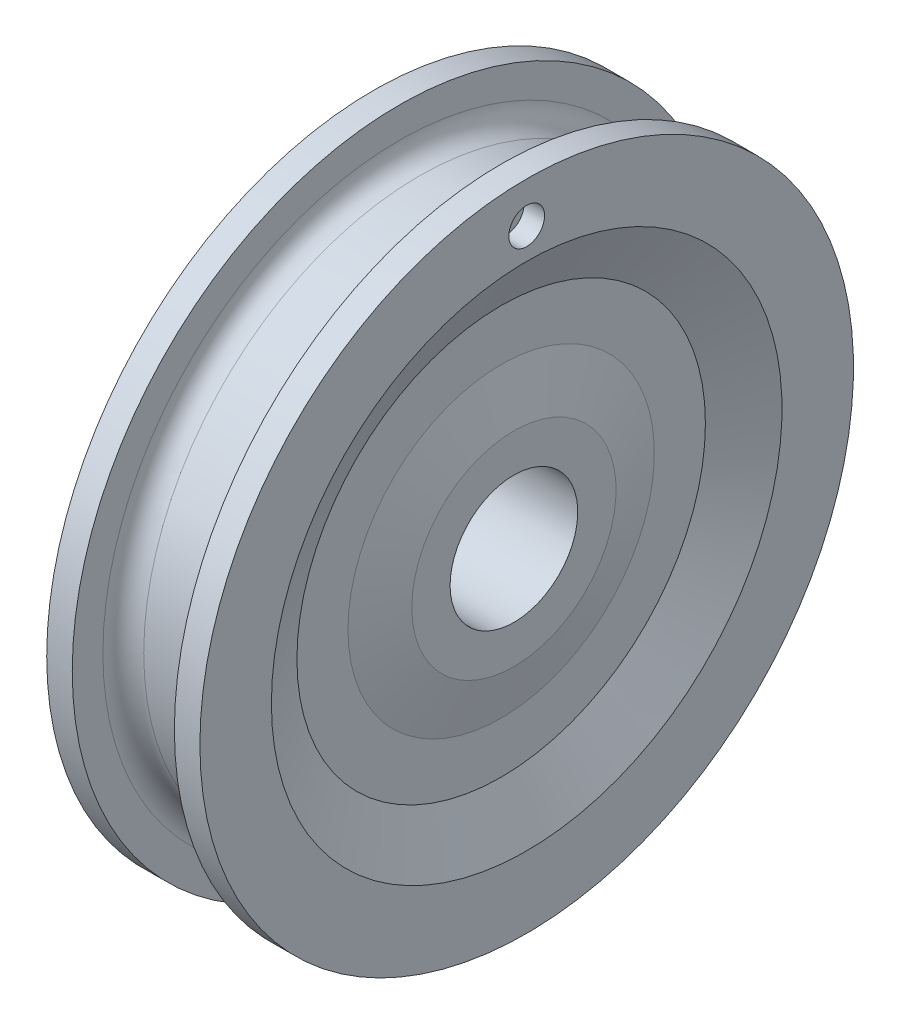
ISO-10303-21;
HEADER;
FILE_DESCRIPTION(('STEP AP214'),'2;1');
FILE_NAME('part.step','',(''),(''),'','','');
FILE_SCHEMA(('AUTOMOTIVE_DESIGN { 1 0 10303 214 1 1 1 1 }'));
ENDSEC;
DATA;
#1=APPLICATION_CONTEXT('core data for automotive mechanical design processes');
#2=APPLICATION_PROTOCOL_DEFINITION('international standard','automotive_design',2000,#1);
#3=PRODUCT_CONTEXT('',#1,'mechanical');
#4=PRODUCT('Part','Part','',(#3));
#5=PRODUCT_RELATED_PRODUCT_CATEGORY('part','',(#4));
#6=PRODUCT_DEFINITION_FORMATION('','',#4);
#7=PRODUCT_DEFINITION_CONTEXT('part definition',#1,'design');
#8=PRODUCT_DEFINITION('design','',#6,#7);
#9=PRODUCT_DEFINITION_SHAPE('','',#8);
#10=(LENGTH_UNIT() NAMED_UNIT(*) SI_UNIT(.MILLI.,.METRE.));
#11=(NAMED_UNIT(*) PLANE_ANGLE_UNIT() SI_UNIT($,.RADIAN.));
#12=(NAMED_UNIT(*) SI_UNIT($,.STERADIAN.) SOLID_ANGLE_UNIT());
#13=UNCERTAINTY_MEASURE_WITH_UNIT(LENGTH_MEASURE(1.E-05),#10,'distance_accuracy_value','');
#14=(GEOMETRIC_REPRESENTATION_CONTEXT(3) GLOBAL_UNCERTAINTY_ASSIGNED_CONTEXT((#13)) GLOBAL_UNIT_ASSIGNED_CONTEXT((#10,
#11,#12)) REPRESENTATION_CONTEXT('',''));
#15=CARTESIAN_POINT('',(0.,0.,0.));
#16=DIRECTION('',(0.,0.,1.));
#17=DIRECTION('',(1.,0.,0.));
#18=AXIS2_PLACEMENT_3D('',#15,#16,#17);
#19=CARTESIAN_POINT('',(1.25,9.99999999999999,0.));
#20=DIRECTION('',(1.,0.,0.));
#21=DIRECTION('',(0.,0.,-1.));
#22=AXIS2_PLACEMENT_3D('',#19,#20,#21);
#23=PLANE('',#22);
#24=CARTESIAN_POINT('',(1.25,0.,0.));
#25=DIRECTION('',(-1.,0.,0.));
#26=DIRECTION('',(0.,0.,1.));
#27=AXIS2_PLACEMENT_3D('',#24,#25,#26);
#28=CIRCLE('',#27,6.25);
#29=CARTESIAN_POINT('',(1.25,0.,6.25));
#30=VERTEX_POINT('',#29);
#31=EDGE_CURVE('E91',#30,#30,#28,.T.);
#32=ORIENTED_EDGE('',*,*,#31,.F.);
#33=EDGE_LOOP('',(#32));
#34=FACE_BOUND('',#33,.T.);
#35=CARTESIAN_POINT('',(1.25,0.,0.));
#36=DIRECTION('',(-1.,0.,0.));
#37=DIRECTION('',(0.,0.,1.));
#38=AXIS2_PLACEMENT_3D('',#35,#36,#37);
#39=CIRCLE('',#38,9.99999999999999);
#40=CARTESIAN_POINT('',(1.25,0.,9.99999999999999));
#41=VERTEX_POINT('',#40);
#42=EDGE_CURVE('E10',#41,#41,#39,.T.);
#43=ORIENTED_EDGE('',*,*,#42,.T.);
#44=EDGE_LOOP('',(#43));
#45=FACE_BOUND('',#44,.T.);
#46=ADVANCED_FACE('F33',(#34,#45),#23,.F.);
#47=CARTESIAN_POINT('',(2.50000000000001,0.,0.));
#48=DIRECTION('',(1.,0.,0.));
#49=DIRECTION('',(0.,0.,-1.));
#50=AXIS2_PLACEMENT_3D('',#47,#48,#49);
#51=CONICAL_SURFACE('',#50,15.,1.32581766366803);
#52=ORIENTED_EDGE('',*,*,#42,.F.);
#53=EDGE_LOOP('',(#52));
#54=FACE_BOUND('',#53,.T.);
#55=CARTESIAN_POINT('',(2.50000000000001,0.,0.));
#56=DIRECTION('',(-1.,0.,0.));
#57=DIRECTION('',(0.,0.,1.));
#58=AXIS2_PLACEMENT_3D('',#55,#56,#57);
#59=CIRCLE('',#58,15.);
#60=CARTESIAN_POINT('',(2.50000000000001,0.,15.));
#61=VERTEX_POINT('',#60);
#62=EDGE_CURVE('E39',#61,#61,#59,.T.);
#63=ORIENTED_EDGE('',*,*,#62,.T.);
#64=EDGE_LOOP('',(#63));
#65=FACE_BOUND('',#64,.T.);
#66=ADVANCED_FACE('F149',(#54,#65),#51,.T.);
#67=CARTESIAN_POINT('',(2.50000000000001,20.,0.));
#68=DIRECTION('',(1.,0.,0.));
#69=DIRECTION('',(0.,0.,-1.));
#70=AXIS2_PLACEMENT_3D('',#67,#68,#69);
#71=PLANE('',#70);
#72=ORIENTED_EDGE('',*,*,#62,.F.);
#73=EDGE_LOOP('',(#72));
#74=FACE_BOUND('',#73,.T.);
#75=CARTESIAN_POINT('',(2.50000000000001,0.,0.));
#76=DIRECTION('',(-1.,0.,0.));
#77=DIRECTION('',(0.,0.,1.));
#78=AXIS2_PLACEMENT_3D('',#75,#76,#77);
#79=CIRCLE('',#78,20.);
#80=CARTESIAN_POINT('',(2.50000000000001,0.,20.));
#81=VERTEX_POINT('',#80);
#82=EDGE_CURVE('E43',#81,#81,#79,.T.);
#83=ORIENTED_EDGE('',*,*,#82,.T.);
#84=EDGE_LOOP('',(#83));
#85=FACE_BOUND('',#84,.T.);
#86=ADVANCED_FACE('F153',(#74,#85),#71,.F.);
#87=CARTESIAN_POINT('',(0.,0.,0.));
#88=DIRECTION('',(-1.,0.,0.));
#89=DIRECTION('',(0.,0.,1.));
#90=AXIS2_PLACEMENT_3D('',#87,#88,#89);
#91=CONICAL_SURFACE('',#90,25.,1.10714871779409);
#92=ORIENTED_EDGE('',*,*,#82,.F.);
#93=EDGE_LOOP('',(#92));
#94=FACE_BOUND('',#93,.T.);
#95=CARTESIAN_POINT('',(0.,0.,0.));
#96=DIRECTION('',(-1.,0.,0.));
#97=DIRECTION('',(0.,0.,1.));
#98=AXIS2_PLACEMENT_3D('',#95,#96,#97);
#99=CIRCLE('',#98,25.);
#100=CARTESIAN_POINT('',(0.,0.,25.));
#101=VERTEX_POINT('',#100);
#102=EDGE_CURVE('E47',#101,#101,#99,.T.);
#103=ORIENTED_EDGE('',*,*,#102,.T.);
#104=EDGE_LOOP('',(#103));
#105=FACE_BOUND('',#104,.T.);
#106=ADVANCED_FACE('F158',(#94,#105),#91,.F.);
#107=CARTESIAN_POINT('',(0.,32.,0.));
#108=DIRECTION('',(1.,0.,0.));
#109=DIRECTION('',(0.,0.,-1.));
#110=AXIS2_PLACEMENT_3D('',#107,#108,#109);
#111=PLANE('',#110);
#112=ORIENTED_EDGE('',*,*,#102,.F.);
#113=EDGE_LOOP('',(#112));
#114=FACE_BOUND('',#113,.T.);
#115=CARTESIAN_POINT('',(0.,0.,0.));
#116=DIRECTION('',(-1.,0.,0.));
#117=DIRECTION('',(0.,0.,1.));
#118=AXIS2_PLACEMENT_3D('',#115,#116,#117);
#119=CIRCLE('',#118,32.);
#120=CARTESIAN_POINT('',(0.,0.,32.));
#121=VERTEX_POINT('',#120);
#122=EDGE_CURVE('E52',#121,#121,#119,.T.);
#123=ORIENTED_EDGE('',*,*,#122,.T.);
#124=EDGE_LOOP('',(#123));
#125=FACE_BOUND('',#124,.T.);
#126=ADVANCED_FACE('F164',(#114,#125),#111,.F.);
#127=CARTESIAN_POINT('',(0.,0.,0.));
#128=DIRECTION('',(-1.,0.,0.));
#129=DIRECTION('',(0.,0.,1.));
#130=AXIS2_PLACEMENT_3D('',#127,#128,#129);
#131=CYLINDRICAL_SURFACE('',#130,32.);
#132=ORIENTED_EDGE('',*,*,#122,.F.);
#133=EDGE_LOOP('',(#132));
#134=FACE_BOUND('',#133,.T.);
#135=CARTESIAN_POINT('',(2.5,0.,0.));
#136=DIRECTION('',(-1.,0.,0.));
#137=DIRECTION('',(0.,0.,1.));
#138=AXIS2_PLACEMENT_3D('',#135,#136,#137);
#139=CIRCLE('',#138,32.);
#140=CARTESIAN_POINT('',(2.5,0.,32.));
#141=VERTEX_POINT('',#140);
#142=EDGE_CURVE('E55',#141,#141,#139,.T.);
#143=ORIENTED_EDGE('',*,*,#142,.T.);
#144=EDGE_LOOP('',(#143));
#145=FACE_BOUND('',#144,.T.);
#146=ADVANCED_FACE('F168',(#134,#145),#131,.T.);
#147=CARTESIAN_POINT('',(2.5,29.,0.));
#148=DIRECTION('',(-1.,0.,0.));
#149=DIRECTION('',(0.,0.,1.));
#150=AXIS2_PLACEMENT_3D('',#147,#148,#149);
#151=PLANE('',#150);
#152=ORIENTED_EDGE('',*,*,#142,.F.);
#153=EDGE_LOOP('',(#152));
#154=FACE_BOUND('',#153,.T.);
#155=CARTESIAN_POINT('',(2.5,0.,0.));
#156=DIRECTION('',(-1.,0.,0.));
#157=DIRECTION('',(0.,0.,1.));
#158=AXIS2_PLACEMENT_3D('',#155,#156,#157);
#159=CIRCLE('',#158,29.);
#160=CARTESIAN_POINT('',(2.5,0.,29.));
#161=VERTEX_POINT('',#160);
#162=EDGE_CURVE('E58',#161,#161,#159,.T.);
#163=ORIENTED_EDGE('',*,*,#162,.T.);
#164=EDGE_LOOP('',(#163));
#165=FACE_BOUND('',#164,.T.);
#166=ADVANCED_FACE('F172',(#154,#165),#151,.F.);
#167=CARTESIAN_POINT('',(4.5,0.,0.));
#168=DIRECTION('',(-1.,0.,0.));
#169=DIRECTION('',(0.,0.,1.));
#170=AXIS2_PLACEMENT_3D('',#167,#168,#169);
#171=TOROIDAL_SURFACE('',#170,29.,2.);
#172=ORIENTED_EDGE('',*,*,#162,.F.);
#173=EDGE_LOOP('',(#172));
#174=FACE_BOUND('',#173,.T.);
#175=CARTESIAN_POINT('',(4.5,0.,0.));
#176=DIRECTION('',(-1.,0.,0.));
#177=DIRECTION('',(0.,0.,1.));
#178=AXIS2_PLACEMENT_3D('',#175,#176,#177);
#179=CIRCLE('',#178,27.);
#180=CARTESIAN_POINT('',(4.5,0.,27.));
#181=VERTEX_POINT('',#180);
#182=EDGE_CURVE('E61',#181,#181,#179,.T.);
#183=ORIENTED_EDGE('',*,*,#182,.T.);
#184=EDGE_LOOP('',(#183));
#185=FACE_BOUND('',#184,.T.);
#186=ADVANCED_FACE('F176',(#174,#185),#171,.F.);
#187=CARTESIAN_POINT('',(0.,0.,0.));
#188=DIRECTION('',(-1.,0.,0.));
#189=DIRECTION('',(0.,0.,1.));
#190=AXIS2_PLACEMENT_3D('',#187,#188,#189);
#191=CYLINDRICAL_SURFACE('',#190,27.);
#192=ORIENTED_EDGE('',*,*,#182,.F.);
#193=EDGE_LOOP('',(#192));
#194=FACE_BOUND('',#193,.T.);
#195=CARTESIAN_POINT('',(10.5,0.,0.));
#196=DIRECTION('',(-1.,0.,0.));
#197=DIRECTION('',(0.,0.,1.));
#198=AXIS2_PLACEMENT_3D('',#195,#196,#197);
#199=CIRCLE('',#198,27.);
#200=CARTESIAN_POINT('',(10.5,0.,27.));
#201=VERTEX_POINT('',#200);
#202=EDGE_CURVE('E64',#201,#201,#199,.T.);
#203=ORIENTED_EDGE('',*,*,#202,.T.);
#204=EDGE_LOOP('',(#203));
#205=FACE_BOUND('',#204,.T.);
#206=ADVANCED_FACE('F180',(#194,#205),#191,.T.);
#207=CARTESIAN_POINT('',(10.5,0.,0.));
#208=DIRECTION('',(-1.,0.,0.));
#209=DIRECTION('',(0.,0.,1.));
#210=AXIS2_PLACEMENT_3D('',#207,#208,#209);
#211=TOROIDAL_SURFACE('',#210,29.,2.);
#212=ORIENTED_EDGE('',*,*,#202,.F.);
#213=EDGE_LOOP('',(#212));
#214=FACE_BOUND('',#213,.T.);
#215=CARTESIAN_POINT('',(12.5,0.,0.));
#216=DIRECTION('',(-1.,0.,0.));
#217=DIRECTION('',(0.,0.,1.));
#218=AXIS2_PLACEMENT_3D('',#215,#216,#217);
#219=CIRCLE('',#218,29.);
#220=CARTESIAN_POINT('',(12.5,0.,29.));
#221=VERTEX_POINT('',#220);
#222=EDGE_CURVE('E67',#221,#221,#219,.T.);
#223=ORIENTED_EDGE('',*,*,#222,.T.);
#224=EDGE_LOOP('',(#223));
#225=FACE_BOUND('',#224,.T.);
#226=ADVANCED_FACE('F184',(#214,#225),#211,.F.);
#227=CARTESIAN_POINT('',(12.5,32.,0.));
#228=DIRECTION('',(1.,0.,0.));
#229=DIRECTION('',(0.,0.,-1.));
#230=AXIS2_PLACEMENT_3D('',#227,#228,#229);
#231=PLANE('',#230);
#232=ORIENTED_EDGE('',*,*,#222,.F.);
#233=EDGE_LOOP('',(#232));
#234=FACE_BOUND('',#233,.T.);
#235=CARTESIAN_POINT('',(12.5,0.,0.));
#236=DIRECTION('',(-1.,0.,0.));
#237=DIRECTION('',(0.,0.,1.));
#238=AXIS2_PLACEMENT_3D('',#235,#236,#237);
#239=CIRCLE('',#238,32.);
#240=CARTESIAN_POINT('',(12.5,0.,32.));
#241=VERTEX_POINT('',#240);
#242=EDGE_CURVE('E70',#241,#241,#239,.T.);
#243=ORIENTED_EDGE('',*,*,#242,.T.);
#244=EDGE_LOOP('',(#243));
#245=FACE_BOUND('',#244,.T.);
#246=ADVANCED_FACE('F188',(#234,#245),#231,.F.);
#247=CARTESIAN_POINT('',(0.,0.,0.));
#248=DIRECTION('',(-1.,0.,0.));
#249=DIRECTION('',(0.,0.,1.));
#250=AXIS2_PLACEMENT_3D('',#247,#248,#249);
#251=CYLINDRICAL_SURFACE('',#250,32.);
#252=ORIENTED_EDGE('',*,*,#242,.F.);
#253=EDGE_LOOP('',(#252));
#254=FACE_BOUND('',#253,.T.);
#255=CARTESIAN_POINT('',(15.,0.,0.));
#256=DIRECTION('',(-1.,0.,0.));
#257=DIRECTION('',(0.,0.,1.));
#258=AXIS2_PLACEMENT_3D('',#255,#256,#257);
#259=CIRCLE('',#258,32.);
#260=CARTESIAN_POINT('',(15.,0.,32.));
#261=VERTEX_POINT('',#260);
#262=EDGE_CURVE('E73',#261,#261,#259,.T.);
#263=ORIENTED_EDGE('',*,*,#262,.T.);
#264=EDGE_LOOP('',(#263));
#265=FACE_BOUND('',#264,.T.);
#266=ADVANCED_FACE('F114',(#254,#265),#251,.T.);
#267=CARTESIAN_POINT('',(15.,25.,0.));
#268=DIRECTION('',(-1.,0.,0.));
#269=DIRECTION('',(0.,0.,1.));
#270=AXIS2_PLACEMENT_3D('',#267,#268,#269);
#271=PLANE('',#270);
#272=CARTESIAN_POINT('',(15.,28.,0.));
#273=DIRECTION('',(1.,0.,0.));
#274=DIRECTION('',(0.,0.,-1.));
#275=AXIS2_PLACEMENT_3D('',#272,#273,#274);
#276=CIRCLE('',#275,1.75);
#277=CARTESIAN_POINT('',(15.,28.,-1.75));
#278=VERTEX_POINT('',#277);
#279=EDGE_CURVE('E95',#278,#278,#276,.T.);
#280=ORIENTED_EDGE('',*,*,#279,.F.);
#281=EDGE_LOOP('',(#280));
#282=FACE_BOUND('',#281,.T.);
#283=ORIENTED_EDGE('',*,*,#262,.F.);
#284=EDGE_LOOP('',(#283));
#285=FACE_BOUND('',#284,.T.);
#286=CARTESIAN_POINT('',(15.,0.,0.));
#287=DIRECTION('',(-1.,0.,0.));
#288=DIRECTION('',(0.,0.,1.));
#289=AXIS2_PLACEMENT_3D('',#286,#287,#288);
#290=CIRCLE('',#289,25.);
#291=CARTESIAN_POINT('',(15.,0.,25.));
#292=VERTEX_POINT('',#291);
#293=EDGE_CURVE('E76',#292,#292,#290,.T.);
#294=ORIENTED_EDGE('',*,*,#293,.T.);
#295=EDGE_LOOP('',(#294));
#296=FACE_BOUND('',#295,.T.);
#297=ADVANCED_FACE('F110',(#282,#285,#296),#271,.F.);
#298=CARTESIAN_POINT('',(12.5,0.,0.));
#299=DIRECTION('',(1.,0.,0.));
#300=DIRECTION('',(0.,0.,-1.));
#301=AXIS2_PLACEMENT_3D('',#298,#299,#300);
#302=CONICAL_SURFACE('',#301,20.,1.10714871779409);
#303=ORIENTED_EDGE('',*,*,#293,.F.);
#304=EDGE_LOOP('',(#303));
#305=FACE_BOUND('',#304,.T.);
#306=CARTESIAN_POINT('',(12.5,0.,0.));
#307=DIRECTION('',(-1.,0.,0.));
#308=DIRECTION('',(0.,0.,1.));
#309=AXIS2_PLACEMENT_3D('',#306,#307,#308);
#310=CIRCLE('',#309,20.);
#311=CARTESIAN_POINT('',(12.5,0.,20.));
#312=VERTEX_POINT('',#311);
#313=EDGE_CURVE('E79',#312,#312,#310,.T.);
#314=ORIENTED_EDGE('',*,*,#313,.T.);
#315=EDGE_LOOP('',(#314));
#316=FACE_BOUND('',#315,.T.);
#317=ADVANCED_FACE('F113',(#305,#316),#302,.F.);
#318=CARTESIAN_POINT('',(12.5,15.,0.));
#319=DIRECTION('',(-1.,0.,0.));
#320=DIRECTION('',(0.,0.,1.));
#321=AXIS2_PLACEMENT_3D('',#318,#319,#320);
#322=PLANE('',#321);
#323=ORIENTED_EDGE('',*,*,#313,.F.);
#324=EDGE_LOOP('',(#323));
#325=FACE_BOUND('',#324,.T.);
#326=CARTESIAN_POINT('',(12.5,0.,0.));
#327=DIRECTION('',(-1.,0.,0.));
#328=DIRECTION('',(0.,0.,1.));
#329=AXIS2_PLACEMENT_3D('',#326,#327,#328);
#330=CIRCLE('',#329,15.);
#331=CARTESIAN_POINT('',(12.5,0.,15.));
#332=VERTEX_POINT('',#331);
#333=EDGE_CURVE('E82',#332,#332,#330,.T.);
#334=ORIENTED_EDGE('',*,*,#333,.T.);
#335=EDGE_LOOP('',(#334));
#336=FACE_BOUND('',#335,.T.);
#337=ADVANCED_FACE('F122',(#325,#336),#322,.F.);
#338=CARTESIAN_POINT('',(13.75,0.,0.));
#339=DIRECTION('',(-1.,0.,0.));
#340=DIRECTION('',(0.,0.,1.));
#341=AXIS2_PLACEMENT_3D('',#338,#339,#340);
#342=CONICAL_SURFACE('',#341,9.99999999999998,1.32581766366803);
#343=ORIENTED_EDGE('',*,*,#333,.F.);
#344=EDGE_LOOP('',(#343));
#345=FACE_BOUND('',#344,.T.);
#346=CARTESIAN_POINT('',(13.75,0.,0.));
#347=DIRECTION('',(-1.,0.,0.));
#348=DIRECTION('',(0.,0.,1.));
#349=AXIS2_PLACEMENT_3D('',#346,#347,#348);
#350=CIRCLE('',#349,9.99999999999998);
#351=CARTESIAN_POINT('',(13.75,0.,9.99999999999998));
#352=VERTEX_POINT('',#351);
#353=EDGE_CURVE('E85',#352,#352,#350,.T.);
#354=ORIENTED_EDGE('',*,*,#353,.T.);
#355=EDGE_LOOP('',(#354));
#356=FACE_BOUND('',#355,.T.);
#357=ADVANCED_FACE('F128',(#345,#356),#342,.T.);
#358=CARTESIAN_POINT('',(13.75,6.25,0.));
#359=DIRECTION('',(-1.,0.,0.));
#360=DIRECTION('',(0.,0.,1.));
#361=AXIS2_PLACEMENT_3D('',#358,#359,#360);
#362=PLANE('',#361);
#363=ORIENTED_EDGE('',*,*,#353,.F.);
#364=EDGE_LOOP('',(#363));
#365=FACE_BOUND('',#364,.T.);
#366=CARTESIAN_POINT('',(13.75,0.,0.));
#367=DIRECTION('',(-1.,0.,0.));
#368=DIRECTION('',(0.,0.,1.));
#369=AXIS2_PLACEMENT_3D('',#366,#367,#368);
#370=CIRCLE('',#369,6.25);
#371=CARTESIAN_POINT('',(13.75,0.,6.25));
#372=VERTEX_POINT('',#371);
#373=EDGE_CURVE('E88',#372,#372,#370,.T.);
#374=ORIENTED_EDGE('',*,*,#373,.T.);
#375=EDGE_LOOP('',(#374));
#376=FACE_BOUND('',#375,.T.);
#377=ADVANCED_FACE('F134',(#365,#376),#362,.F.);
#378=CARTESIAN_POINT('',(0.,0.,0.));
#379=DIRECTION('',(-1.,0.,0.));
#380=DIRECTION('',(0.,0.,1.));
#381=AXIS2_PLACEMENT_3D('',#378,#379,#380);
#382=CYLINDRICAL_SURFACE('',#381,6.25);
#383=ORIENTED_EDGE('',*,*,#373,.F.);
#384=EDGE_LOOP('',(#383));
#385=FACE_BOUND('',#384,.T.);
#386=ORIENTED_EDGE('',*,*,#31,.T.);
#387=EDGE_LOOP('',(#386));
#388=FACE_BOUND('',#387,.T.);
#389=ADVANCED_FACE('F106',(#385,#388),#382,.F.);
#390=CARTESIAN_POINT('',(13.,28.,0.));
#391=DIRECTION('',(1.,0.,0.));
#392=DIRECTION('',(0.,0.,-1.));
#393=AXIS2_PLACEMENT_3D('',#390,#391,#392);
#394=CYLINDRICAL_SURFACE('',#393,1.75);
#395=CARTESIAN_POINT('',(13.,28.,0.));
#396=DIRECTION('',(1.,0.,0.));
#397=DIRECTION('',(0.,0.,-1.));
#398=AXIS2_PLACEMENT_3D('',#395,#396,#397);
#399=CIRCLE('',#398,1.75);
#400=CARTESIAN_POINT('',(13.,28.,-1.75));
#401=VERTEX_POINT('',#400);
#402=EDGE_CURVE('E94',#401,#401,#399,.T.);
#403=ORIENTED_EDGE('',*,*,#402,.F.);
#404=EDGE_LOOP('',(#403));
#405=FACE_BOUND('',#404,.T.);
#406=ORIENTED_EDGE('',*,*,#279,.T.);
#407=EDGE_LOOP('',(#406));
#408=FACE_BOUND('',#407,.T.);
#409=ADVANCED_FACE('F103',(#405,#408),#394,.F.);
#410=CARTESIAN_POINT('',(13.,28.,0.));
#411=DIRECTION('',(1.,0.,0.));
#412=DIRECTION('',(0.,0.,-1.));
#413=AXIS2_PLACEMENT_3D('',#410,#411,#412);
#414=PLANE('',#413);
#415=ORIENTED_EDGE('',*,*,#402,.T.);
#416=EDGE_LOOP('',(#415));
#417=FACE_BOUND('',#416,.T.);
#418=ADVANCED_FACE('F101',(#417),#414,.T.);
#419=CLOSED_SHELL('',(#46,#66,#86,#106,#126,#146,#166,#186,#206,#226,#246,#266,#297,#317,#337,
#357,#377,#389,#409,#418));
#420=MANIFOLD_SOLID_BREP('B2',#419);
#421=ADVANCED_BREP_SHAPE_REPRESENTATION('',(#18,#420),#14);
#422=SHAPE_DEFINITION_REPRESENTATION(#9,#421);
ENDSEC;
END-ISO-10303-21;
